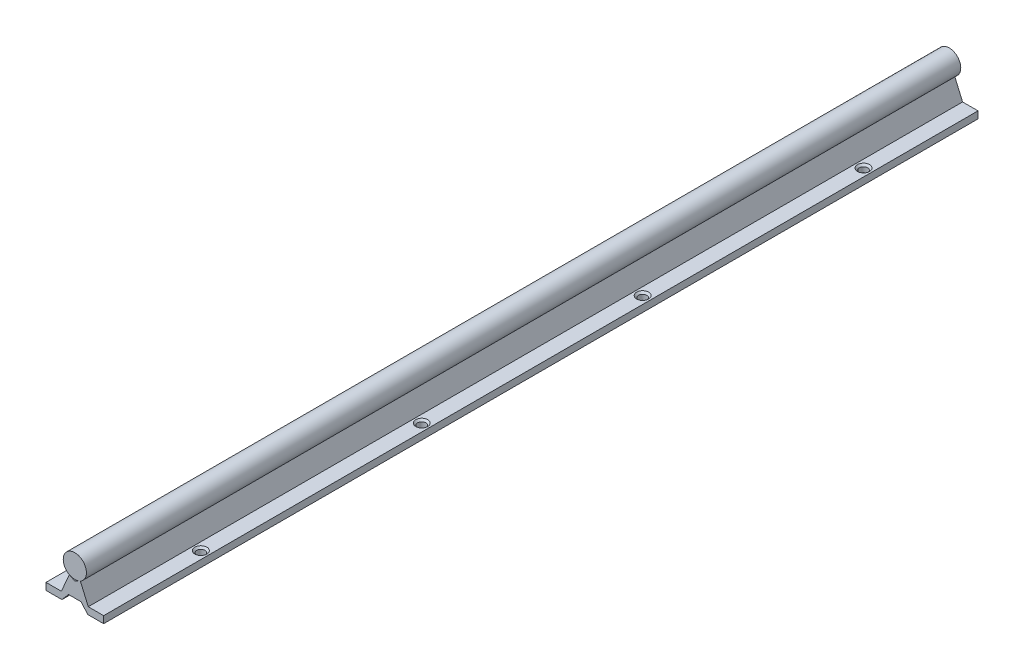
ISO-10303-21;
HEADER;
FILE_DESCRIPTION(('STEP AP214'),'2;1');
FILE_NAME('part.step','',(''),(''),'','','');
FILE_SCHEMA(('AUTOMOTIVE_DESIGN { 1 0 10303 214 1 1 1 1 }'));
ENDSEC;
DATA;
#1=APPLICATION_CONTEXT('core data for automotive mechanical design processes');
#2=APPLICATION_PROTOCOL_DEFINITION('international standard','automotive_design',2000,#1);
#3=PRODUCT_CONTEXT('',#1,'mechanical');
#4=PRODUCT('Part','Part','',(#3));
#5=PRODUCT_RELATED_PRODUCT_CATEGORY('part','',(#4));
#6=PRODUCT_DEFINITION_FORMATION('','',#4);
#7=PRODUCT_DEFINITION_CONTEXT('part definition',#1,'design');
#8=PRODUCT_DEFINITION('design','',#6,#7);
#9=PRODUCT_DEFINITION_SHAPE('','',#8);
#10=(LENGTH_UNIT() NAMED_UNIT(*) SI_UNIT(.MILLI.,.METRE.));
#11=(NAMED_UNIT(*) PLANE_ANGLE_UNIT() SI_UNIT($,.RADIAN.));
#12=(NAMED_UNIT(*) SI_UNIT($,.STERADIAN.) SOLID_ANGLE_UNIT());
#13=UNCERTAINTY_MEASURE_WITH_UNIT(LENGTH_MEASURE(1.E-05),#10,'distance_accuracy_value','');
#14=(GEOMETRIC_REPRESENTATION_CONTEXT(3) GLOBAL_UNCERTAINTY_ASSIGNED_CONTEXT((#13)) GLOBAL_UNIT_ASSIGNED_CONTEXT((#10,
#11,#12)) REPRESENTATION_CONTEXT('',''));
#15=CARTESIAN_POINT('',(0.,0.,0.));
#16=DIRECTION('',(0.,0.,1.));
#17=DIRECTION('',(1.,0.,0.));
#18=AXIS2_PLACEMENT_3D('',#15,#16,#17);
#19=CARTESIAN_POINT('',(0.,9.017,-301.625));
#20=DIRECTION('',(0.,0.,1.));
#21=DIRECTION('',(1.,0.,0.));
#22=AXIS2_PLACEMENT_3D('',#19,#20,#21);
#23=CYLINDRICAL_SURFACE('',#22,8.001);
#24=CARTESIAN_POINT('',(0.,9.017,301.625));
#25=DIRECTION('',(0.,0.,1.));
#26=DIRECTION('',(1.,0.,0.));
#27=AXIS2_PLACEMENT_3D('',#24,#25,#26);
#28=CIRCLE('',#27,8.001);
#29=CARTESIAN_POINT('',(3.81,1.98138339589201,301.625));
#30=VERTEX_POINT('',#29);
#31=CARTESIAN_POINT('',(-3.81,1.98138339589201,301.625));
#32=VERTEX_POINT('',#31);
#33=EDGE_CURVE('E438',#30,#32,#28,.T.);
#34=ORIENTED_EDGE('',*,*,#33,.F.);
#35=DIRECTION('',(0.,0.,1.));
#36=VECTOR('',#35,1.);
#37=CARTESIAN_POINT('',(3.81,1.98138339589201,-301.625));
#38=LINE('',#37,#36);
#39=CARTESIAN_POINT('',(3.81,1.98138339589201,-301.625));
#40=VERTEX_POINT('',#39);
#41=EDGE_CURVE('E473',#40,#30,#38,.T.);
#42=ORIENTED_EDGE('',*,*,#41,.F.);
#43=CARTESIAN_POINT('',(0.,9.017,-301.625));
#44=DIRECTION('',(0.,0.,1.));
#45=DIRECTION('',(1.,0.,0.));
#46=AXIS2_PLACEMENT_3D('',#43,#44,#45);
#47=CIRCLE('',#46,8.001);
#48=CARTESIAN_POINT('',(-3.81,1.98138339589201,-301.625));
#49=VERTEX_POINT('',#48);
#50=EDGE_CURVE('E475',#40,#49,#47,.T.);
#51=ORIENTED_EDGE('',*,*,#50,.T.);
#52=DIRECTION('',(0.,0.,1.));
#53=VECTOR('',#52,1.);
#54=CARTESIAN_POINT('',(-3.81,1.98138339589201,-301.625));
#55=LINE('',#54,#53);
#56=EDGE_CURVE('E113',#49,#32,#55,.T.);
#57=ORIENTED_EDGE('',*,*,#56,.T.);
#58=EDGE_LOOP('',(#34,#42,#51,#57));
#59=FACE_BOUND('',#58,.T.);
#60=ADVANCED_FACE('F95',(#59),#23,.T.);
#61=CARTESIAN_POINT('',(-3.57206746255299,1.85764702344058,301.625));
#62=VERTEX_POINT('',#61);
#63=CARTESIAN_POINT('',(3.57206746255307,1.85764702344062,301.625));
#64=VERTEX_POINT('',#63);
#65=EDGE_CURVE('E209',#62,#64,#28,.T.);
#66=ORIENTED_EDGE('',*,*,#65,.F.);
#67=DIRECTION('',(0.,0.,1.));
#68=VECTOR('',#67,1.);
#69=CARTESIAN_POINT('',(-3.57206746255299,1.85764702344058,-301.625));
#70=LINE('',#69,#68);
#71=CARTESIAN_POINT('',(-3.57206746255299,1.85764702344058,-301.625));
#72=VERTEX_POINT('',#71);
#73=EDGE_CURVE('E227',#72,#62,#70,.T.);
#74=ORIENTED_EDGE('',*,*,#73,.F.);
#75=CARTESIAN_POINT('',(3.57206746255307,1.85764702344062,-301.625));
#76=VERTEX_POINT('',#75);
#77=EDGE_CURVE('E478',#72,#76,#47,.T.);
#78=ORIENTED_EDGE('',*,*,#77,.T.);
#79=DIRECTION('',(0.,0.,1.));
#80=VECTOR('',#79,1.);
#81=CARTESIAN_POINT('',(3.57206746255307,1.85764702344062,-301.625));
#82=LINE('',#81,#80);
#83=EDGE_CURVE('E481',#76,#64,#82,.T.);
#84=ORIENTED_EDGE('',*,*,#83,.T.);
#85=EDGE_LOOP('',(#66,#74,#78,#84));
#86=FACE_BOUND('',#85,.T.);
#87=ADVANCED_FACE('F492',(#86),#23,.T.);
#88=CARTESIAN_POINT('',(0.,0.,301.625));
#89=DIRECTION('',(0.,0.,1.));
#90=DIRECTION('',(1.,0.,0.));
#91=AXIS2_PLACEMENT_3D('',#88,#89,#90);
#92=PLANE('',#91);
#93=ORIENTED_EDGE('',*,*,#33,.T.);
#94=DIRECTION('',(-0.396360542946559,-0.918094940621671,0.));
#95=VECTOR('',#94,1.);
#96=CARTESIAN_POINT('',(-3.81,1.98138339589201,301.625));
#97=LINE('',#96,#95);
#98=CARTESIAN_POINT('',(-9.271,-10.668,301.625));
#99=VERTEX_POINT('',#98);
#100=EDGE_CURVE('E228',#32,#99,#97,.T.);
#101=ORIENTED_EDGE('',*,*,#100,.T.);
#102=DIRECTION('',(-1.,0.,0.));
#103=VECTOR('',#102,1.);
#104=CARTESIAN_POINT('',(-9.271,-10.668,301.625));
#105=LINE('',#104,#103);
#106=CARTESIAN_POINT('',(-19.8882,-10.668,301.625));
#107=VERTEX_POINT('',#106);
#108=EDGE_CURVE('E232',#99,#107,#105,.T.);
#109=ORIENTED_EDGE('',*,*,#108,.T.);
#110=DIRECTION('',(0.,-1.,0.));
#111=VECTOR('',#110,1.);
#112=CARTESIAN_POINT('',(-19.8882,-10.668,301.625));
#113=LINE('',#112,#111);
#114=CARTESIAN_POINT('',(-19.8882,-15.494,301.625));
#115=VERTEX_POINT('',#114);
#116=EDGE_CURVE('E242',#107,#115,#113,.T.);
#117=ORIENTED_EDGE('',*,*,#116,.T.);
#118=DIRECTION('',(1.,0.,0.));
#119=VECTOR('',#118,1.);
#120=CARTESIAN_POINT('',(-19.8882,-15.494,301.625));
#121=LINE('',#120,#119);
#122=CARTESIAN_POINT('',(-8.89,-15.494,301.625));
#123=VERTEX_POINT('',#122);
#124=EDGE_CURVE('E245',#115,#123,#121,.T.);
#125=ORIENTED_EDGE('',*,*,#124,.T.);
#126=DIRECTION('',(0.646593359584783,0.762834862431486,0.));
#127=VECTOR('',#126,1.);
#128=CARTESIAN_POINT('',(-8.89,-15.494,301.625));
#129=LINE('',#128,#127);
#130=CARTESIAN_POINT('',(-4.3688,-10.16,301.625));
#131=VERTEX_POINT('',#130);
#132=EDGE_CURVE('E248',#123,#131,#129,.T.);
#133=ORIENTED_EDGE('',*,*,#132,.T.);
#134=DIRECTION('',(1.,0.,0.));
#135=VECTOR('',#134,1.);
#136=CARTESIAN_POINT('',(-4.3688,-10.16,301.625));
#137=LINE('',#136,#135);
#138=CARTESIAN_POINT('',(4.3688,-10.16,301.625));
#139=VERTEX_POINT('',#138);
#140=EDGE_CURVE('E251',#131,#139,#137,.T.);
#141=ORIENTED_EDGE('',*,*,#140,.T.);
#142=DIRECTION('',(0.646593359584783,-0.762834862431486,0.));
#143=VECTOR('',#142,1.);
#144=CARTESIAN_POINT('',(4.3688,-10.16,301.625));
#145=LINE('',#144,#143);
#146=CARTESIAN_POINT('',(8.89,-15.494,301.625));
#147=VERTEX_POINT('',#146);
#148=EDGE_CURVE('E254',#139,#147,#145,.T.);
#149=ORIENTED_EDGE('',*,*,#148,.T.);
#150=DIRECTION('',(1.,0.,0.));
#151=VECTOR('',#150,1.);
#152=CARTESIAN_POINT('',(8.89,-15.494,301.625));
#153=LINE('',#152,#151);
#154=CARTESIAN_POINT('',(19.8882,-15.494,301.625));
#155=VERTEX_POINT('',#154);
#156=EDGE_CURVE('E257',#147,#155,#153,.T.);
#157=ORIENTED_EDGE('',*,*,#156,.T.);
#158=DIRECTION('',(0.,1.,0.));
#159=VECTOR('',#158,1.);
#160=CARTESIAN_POINT('',(19.8882,-15.494,301.625));
#161=LINE('',#160,#159);
#162=CARTESIAN_POINT('',(19.8882,-10.668,301.625));
#163=VERTEX_POINT('',#162);
#164=EDGE_CURVE('E260',#155,#163,#161,.T.);
#165=ORIENTED_EDGE('',*,*,#164,.T.);
#166=DIRECTION('',(-1.,0.,0.));
#167=VECTOR('',#166,1.);
#168=CARTESIAN_POINT('',(19.8882,-10.668,301.625));
#169=LINE('',#168,#167);
#170=CARTESIAN_POINT('',(9.271,-10.668,301.625));
#171=VERTEX_POINT('',#170);
#172=EDGE_CURVE('E263',#163,#171,#169,.T.);
#173=ORIENTED_EDGE('',*,*,#172,.T.);
#174=DIRECTION('',(-0.396360542946559,0.918094940621671,0.));
#175=VECTOR('',#174,1.);
#176=CARTESIAN_POINT('',(9.271,-10.668,301.625));
#177=LINE('',#176,#175);
#178=EDGE_CURVE('E213',#171,#30,#177,.T.);
#179=ORIENTED_EDGE('',*,*,#178,.T.);
#180=EDGE_LOOP('',(#93,#101,#109,#117,#125,#133,#141,#149,#157,#165,#173,#179));
#181=FACE_BOUND('',#180,.T.);
#182=DIRECTION('',(-0.887199320305606,0.461386352257272,0.));
#183=VECTOR('',#182,1.);
#184=CARTESIAN_POINT('',(0.,0.,301.625));
#185=LINE('',#184,#183);
#186=CARTESIAN_POINT('',(0.,0.,301.625));
#187=VERTEX_POINT('',#186);
#188=EDGE_CURVE('E207',#187,#62,#185,.T.);
#189=ORIENTED_EDGE('',*,*,#188,.T.);
#190=ORIENTED_EDGE('',*,*,#65,.T.);
#191=DIRECTION('',(-0.887199320305605,-0.461386352257272,0.));
#192=VECTOR('',#191,1.);
#193=CARTESIAN_POINT('',(3.81,1.98138339589201,301.625));
#194=LINE('',#193,#192);
#195=EDGE_CURVE('E203',#64,#187,#194,.T.);
#196=ORIENTED_EDGE('',*,*,#195,.T.);
#197=EDGE_LOOP('',(#189,#190,#196));
#198=FACE_BOUND('',#197,.T.);
#199=ADVANCED_FACE('F205',(#181,#198),#92,.T.);
#200=CARTESIAN_POINT('',(0.,0.,-301.625));
#201=DIRECTION('',(0.,0.,1.));
#202=DIRECTION('',(1.,0.,0.));
#203=AXIS2_PLACEMENT_3D('',#200,#201,#202);
#204=PLANE('',#203);
#205=DIRECTION('',(-0.396360542946559,-0.918094940621671,0.));
#206=VECTOR('',#205,1.);
#207=CARTESIAN_POINT('',(-3.81,1.98138339589201,-301.625));
#208=LINE('',#207,#206);
#209=CARTESIAN_POINT('',(-9.271,-10.668,-301.625));
#210=VERTEX_POINT('',#209);
#211=EDGE_CURVE('E439',#49,#210,#208,.T.);
#212=ORIENTED_EDGE('',*,*,#211,.F.);
#213=ORIENTED_EDGE('',*,*,#50,.F.);
#214=DIRECTION('',(-0.396360542946559,0.918094940621671,0.));
#215=VECTOR('',#214,1.);
#216=CARTESIAN_POINT('',(9.271,-10.668,-301.625));
#217=LINE('',#216,#215);
#218=CARTESIAN_POINT('',(9.271,-10.668,-301.625));
#219=VERTEX_POINT('',#218);
#220=EDGE_CURVE('E470',#219,#40,#217,.T.);
#221=ORIENTED_EDGE('',*,*,#220,.F.);
#222=DIRECTION('',(-1.,0.,0.));
#223=VECTOR('',#222,1.);
#224=CARTESIAN_POINT('',(19.8882,-10.668,-301.625));
#225=LINE('',#224,#223);
#226=CARTESIAN_POINT('',(19.8882,-10.668,-301.625));
#227=VERTEX_POINT('',#226);
#228=EDGE_CURVE('E469',#227,#219,#225,.T.);
#229=ORIENTED_EDGE('',*,*,#228,.F.);
#230=DIRECTION('',(0.,1.,0.));
#231=VECTOR('',#230,1.);
#232=CARTESIAN_POINT('',(19.8882,-15.494,-301.625));
#233=LINE('',#232,#231);
#234=CARTESIAN_POINT('',(19.8882,-15.494,-301.625));
#235=VERTEX_POINT('',#234);
#236=EDGE_CURVE('E466',#235,#227,#233,.T.);
#237=ORIENTED_EDGE('',*,*,#236,.F.);
#238=DIRECTION('',(1.,0.,0.));
#239=VECTOR('',#238,1.);
#240=CARTESIAN_POINT('',(8.89,-15.494,-301.625));
#241=LINE('',#240,#239);
#242=CARTESIAN_POINT('',(8.89,-15.494,-301.625));
#243=VERTEX_POINT('',#242);
#244=EDGE_CURVE('E463',#243,#235,#241,.T.);
#245=ORIENTED_EDGE('',*,*,#244,.F.);
#246=DIRECTION('',(0.646593359584783,-0.762834862431486,0.));
#247=VECTOR('',#246,1.);
#248=CARTESIAN_POINT('',(4.3688,-10.16,-301.625));
#249=LINE('',#248,#247);
#250=CARTESIAN_POINT('',(4.3688,-10.16,-301.625));
#251=VERTEX_POINT('',#250);
#252=EDGE_CURVE('E460',#251,#243,#249,.T.);
#253=ORIENTED_EDGE('',*,*,#252,.F.);
#254=DIRECTION('',(1.,0.,0.));
#255=VECTOR('',#254,1.);
#256=CARTESIAN_POINT('',(-4.3688,-10.16,-301.625));
#257=LINE('',#256,#255);
#258=CARTESIAN_POINT('',(-4.3688,-10.16,-301.625));
#259=VERTEX_POINT('',#258);
#260=EDGE_CURVE('E457',#259,#251,#257,.T.);
#261=ORIENTED_EDGE('',*,*,#260,.F.);
#262=DIRECTION('',(0.646593359584783,0.762834862431486,0.));
#263=VECTOR('',#262,1.);
#264=CARTESIAN_POINT('',(-8.89,-15.494,-301.625));
#265=LINE('',#264,#263);
#266=CARTESIAN_POINT('',(-8.89,-15.494,-301.625));
#267=VERTEX_POINT('',#266);
#268=EDGE_CURVE('E454',#267,#259,#265,.T.);
#269=ORIENTED_EDGE('',*,*,#268,.F.);
#270=DIRECTION('',(1.,0.,0.));
#271=VECTOR('',#270,1.);
#272=CARTESIAN_POINT('',(-19.8882,-15.494,-301.625));
#273=LINE('',#272,#271);
#274=CARTESIAN_POINT('',(-19.8882,-15.494,-301.625));
#275=VERTEX_POINT('',#274);
#276=EDGE_CURVE('E451',#275,#267,#273,.T.);
#277=ORIENTED_EDGE('',*,*,#276,.F.);
#278=DIRECTION('',(0.,-1.,0.));
#279=VECTOR('',#278,1.);
#280=CARTESIAN_POINT('',(-19.8882,-10.668,-301.625));
#281=LINE('',#280,#279);
#282=CARTESIAN_POINT('',(-19.8882,-10.668,-301.625));
#283=VERTEX_POINT('',#282);
#284=EDGE_CURVE('E444',#283,#275,#281,.T.);
#285=ORIENTED_EDGE('',*,*,#284,.F.);
#286=DIRECTION('',(-1.,0.,0.));
#287=VECTOR('',#286,1.);
#288=CARTESIAN_POINT('',(-9.271,-10.668,-301.625));
#289=LINE('',#288,#287);
#290=EDGE_CURVE('E442',#210,#283,#289,.T.);
#291=ORIENTED_EDGE('',*,*,#290,.F.);
#292=EDGE_LOOP('',(#212,#213,#221,#229,#237,#245,#253,#261,#269,#277,#285,#291));
#293=FACE_BOUND('',#292,.T.);
#294=ORIENTED_EDGE('',*,*,#77,.F.);
#295=DIRECTION('',(-0.887199320305606,0.461386352257272,0.));
#296=VECTOR('',#295,1.);
#297=CARTESIAN_POINT('',(0.,0.,-301.625));
#298=LINE('',#297,#296);
#299=CARTESIAN_POINT('',(0.,0.,-301.625));
#300=VERTEX_POINT('',#299);
#301=EDGE_CURVE('E212',#300,#72,#298,.T.);
#302=ORIENTED_EDGE('',*,*,#301,.F.);
#303=DIRECTION('',(-0.887199320305605,-0.461386352257272,0.));
#304=VECTOR('',#303,1.);
#305=CARTESIAN_POINT('',(3.81,1.98138339589201,-301.625));
#306=LINE('',#305,#304);
#307=EDGE_CURVE('E219',#76,#300,#306,.T.);
#308=ORIENTED_EDGE('',*,*,#307,.F.);
#309=EDGE_LOOP('',(#294,#302,#308));
#310=FACE_BOUND('',#309,.T.);
#311=ADVANCED_FACE('F369',(#293,#310),#204,.F.);
#312=CARTESIAN_POINT('',(3.81,1.98138339589201,-301.625));
#313=DIRECTION('',(-0.461386352257272,0.887199320305606,0.));
#314=DIRECTION('',(-0.887199320305606,-0.461386352257272,0.));
#315=AXIS2_PLACEMENT_3D('',#312,#313,#314);
#316=PLANE('',#315);
#317=ORIENTED_EDGE('',*,*,#195,.F.);
#318=ORIENTED_EDGE('',*,*,#83,.F.);
#319=ORIENTED_EDGE('',*,*,#307,.T.);
#320=DIRECTION('',(0.,0.,1.));
#321=VECTOR('',#320,1.);
#322=CARTESIAN_POINT('',(0.,0.,-301.625));
#323=LINE('',#322,#321);
#324=EDGE_CURVE('E216',#300,#187,#323,.T.);
#325=ORIENTED_EDGE('',*,*,#324,.T.);
#326=EDGE_LOOP('',(#317,#318,#319,#325));
#327=FACE_BOUND('',#326,.T.);
#328=ADVANCED_FACE('F217',(#327),#316,.T.);
#329=CARTESIAN_POINT('',(9.271,-10.668,-301.625));
#330=DIRECTION('',(0.918094940621671,0.396360542946559,0.));
#331=DIRECTION('',(-0.396360542946559,0.918094940621671,0.));
#332=AXIS2_PLACEMENT_3D('',#329,#330,#331);
#333=PLANE('',#332);
#334=ORIENTED_EDGE('',*,*,#178,.F.);
#335=DIRECTION('',(0.,0.,1.));
#336=VECTOR('',#335,1.);
#337=CARTESIAN_POINT('',(9.271,-10.668,-301.625));
#338=LINE('',#337,#336);
#339=EDGE_CURVE('E196',#219,#171,#338,.T.);
#340=ORIENTED_EDGE('',*,*,#339,.F.);
#341=ORIENTED_EDGE('',*,*,#220,.T.);
#342=ORIENTED_EDGE('',*,*,#41,.T.);
#343=EDGE_LOOP('',(#334,#340,#341,#342));
#344=FACE_BOUND('',#343,.T.);
#345=ADVANCED_FACE('F374',(#344),#333,.T.);
#346=CARTESIAN_POINT('',(19.8882,-10.668,-301.625));
#347=DIRECTION('',(0.,1.,0.));
#348=DIRECTION('',(-1.,0.,0.));
#349=AXIS2_PLACEMENT_3D('',#346,#347,#348);
#350=PLANE('',#349);
#351=CARTESIAN_POINT('',(14.5796,-10.668,-227.965));
#352=DIRECTION('',(0.,1.,0.));
#353=DIRECTION('',(-1.,0.,0.));
#354=AXIS2_PLACEMENT_3D('',#351,#352,#353);
#355=CIRCLE('',#354,4.14020000000005);
#356=CARTESIAN_POINT('',(10.4394,-10.668,-227.965));
#357=VERTEX_POINT('',#356);
#358=EDGE_CURVE('E309',#357,#357,#355,.F.);
#359=ORIENTED_EDGE('',*,*,#358,.T.);
#360=EDGE_LOOP('',(#359));
#361=FACE_BOUND('',#360,.T.);
#362=CARTESIAN_POINT('',(14.5796,-10.668,-75.5650000000001));
#363=DIRECTION('',(0.,1.,0.));
#364=DIRECTION('',(-1.,0.,0.));
#365=AXIS2_PLACEMENT_3D('',#362,#363,#364);
#366=CIRCLE('',#365,4.14020000000005);
#367=CARTESIAN_POINT('',(10.4394,-10.668,-75.5650000000001));
#368=VERTEX_POINT('',#367);
#369=EDGE_CURVE('E306',#368,#368,#366,.F.);
#370=ORIENTED_EDGE('',*,*,#369,.T.);
#371=EDGE_LOOP('',(#370));
#372=FACE_BOUND('',#371,.T.);
#373=CARTESIAN_POINT('',(14.5796,-10.668,76.835));
#374=DIRECTION('',(0.,1.,0.));
#375=DIRECTION('',(-1.,0.,0.));
#376=AXIS2_PLACEMENT_3D('',#373,#374,#375);
#377=CIRCLE('',#376,4.14020000000005);
#378=CARTESIAN_POINT('',(10.4394,-10.668,76.835));
#379=VERTEX_POINT('',#378);
#380=EDGE_CURVE('E303',#379,#379,#377,.F.);
#381=ORIENTED_EDGE('',*,*,#380,.T.);
#382=EDGE_LOOP('',(#381));
#383=FACE_BOUND('',#382,.T.);
#384=CARTESIAN_POINT('',(14.5796,-10.668,229.235));
#385=DIRECTION('',(0.,1.,0.));
#386=DIRECTION('',(-1.,0.,0.));
#387=AXIS2_PLACEMENT_3D('',#384,#385,#386);
#388=CIRCLE('',#387,4.14020000000004);
#389=CARTESIAN_POINT('',(10.4394,-10.668,229.235));
#390=VERTEX_POINT('',#389);
#391=EDGE_CURVE('E300',#390,#390,#388,.F.);
#392=ORIENTED_EDGE('',*,*,#391,.T.);
#393=EDGE_LOOP('',(#392));
#394=FACE_BOUND('',#393,.T.);
#395=ORIENTED_EDGE('',*,*,#172,.F.);
#396=DIRECTION('',(0.,0.,1.));
#397=VECTOR('',#396,1.);
#398=CARTESIAN_POINT('',(19.8882,-10.668,-301.625));
#399=LINE('',#398,#397);
#400=EDGE_CURVE('E270',#227,#163,#399,.T.);
#401=ORIENTED_EDGE('',*,*,#400,.F.);
#402=ORIENTED_EDGE('',*,*,#228,.T.);
#403=ORIENTED_EDGE('',*,*,#339,.T.);
#404=EDGE_LOOP('',(#395,#401,#402,#403));
#405=FACE_BOUND('',#404,.T.);
#406=ADVANCED_FACE('F380',(#361,#372,#383,#394,#405),#350,.T.);
#407=CARTESIAN_POINT('',(19.8882,-15.494,-301.625));
#408=DIRECTION('',(1.,0.,0.));
#409=DIRECTION('',(0.,1.,0.));
#410=AXIS2_PLACEMENT_3D('',#407,#408,#409);
#411=PLANE('',#410);
#412=ORIENTED_EDGE('',*,*,#164,.F.);
#413=DIRECTION('',(0.,0.,1.));
#414=VECTOR('',#413,1.);
#415=CARTESIAN_POINT('',(19.8882,-15.494,-301.625));
#416=LINE('',#415,#414);
#417=EDGE_CURVE('E273',#235,#155,#416,.T.);
#418=ORIENTED_EDGE('',*,*,#417,.F.);
#419=ORIENTED_EDGE('',*,*,#236,.T.);
#420=ORIENTED_EDGE('',*,*,#400,.T.);
#421=EDGE_LOOP('',(#412,#418,#419,#420));
#422=FACE_BOUND('',#421,.T.);
#423=ADVANCED_FACE('F390',(#422),#411,.T.);
#424=CARTESIAN_POINT('',(8.89,-15.494,-301.625));
#425=DIRECTION('',(0.,-1.,0.));
#426=DIRECTION('',(1.,0.,0.));
#427=AXIS2_PLACEMENT_3D('',#424,#425,#426);
#428=PLANE('',#427);
#429=CARTESIAN_POINT('',(14.5796,-15.494,-75.5650000000001));
#430=DIRECTION('',(0.,1.,0.));
#431=DIRECTION('',(-1.,0.,0.));
#432=AXIS2_PLACEMENT_3D('',#429,#430,#431);
#433=CIRCLE('',#432,2.8702);
#434=CARTESIAN_POINT('',(11.7094,-15.494,-75.5650000000001));
#435=VERTEX_POINT('',#434);
#436=EDGE_CURVE('E737',#435,#435,#433,.T.);
#437=ORIENTED_EDGE('',*,*,#436,.T.);
#438=EDGE_LOOP('',(#437));
#439=FACE_BOUND('',#438,.T.);
#440=CARTESIAN_POINT('',(14.5796,-15.494,76.835));
#441=DIRECTION('',(0.,1.,0.));
#442=DIRECTION('',(-1.,0.,0.));
#443=AXIS2_PLACEMENT_3D('',#440,#441,#442);
#444=CIRCLE('',#443,2.8702);
#445=CARTESIAN_POINT('',(11.7094,-15.494,76.835));
#446=VERTEX_POINT('',#445);
#447=EDGE_CURVE('E731',#446,#446,#444,.T.);
#448=ORIENTED_EDGE('',*,*,#447,.T.);
#449=EDGE_LOOP('',(#448));
#450=FACE_BOUND('',#449,.T.);
#451=CARTESIAN_POINT('',(14.5796,-15.494,-227.965));
#452=DIRECTION('',(0.,1.,0.));
#453=DIRECTION('',(-1.,0.,0.));
#454=AXIS2_PLACEMENT_3D('',#451,#452,#453);
#455=CIRCLE('',#454,2.8702);
#456=CARTESIAN_POINT('',(11.7094,-15.494,-227.965));
#457=VERTEX_POINT('',#456);
#458=EDGE_CURVE('E743',#457,#457,#455,.T.);
#459=ORIENTED_EDGE('',*,*,#458,.T.);
#460=EDGE_LOOP('',(#459));
#461=FACE_BOUND('',#460,.T.);
#462=CARTESIAN_POINT('',(14.5796,-15.494,229.235));
#463=DIRECTION('',(0.,1.,0.));
#464=DIRECTION('',(-1.,0.,0.));
#465=AXIS2_PLACEMENT_3D('',#462,#463,#464);
#466=CIRCLE('',#465,2.8702);
#467=CARTESIAN_POINT('',(11.7094,-15.494,229.235));
#468=VERTEX_POINT('',#467);
#469=EDGE_CURVE('E229',#468,#468,#466,.T.);
#470=ORIENTED_EDGE('',*,*,#469,.T.);
#471=EDGE_LOOP('',(#470));
#472=FACE_BOUND('',#471,.T.);
#473=ORIENTED_EDGE('',*,*,#156,.F.);
#474=DIRECTION('',(0.,0.,1.));
#475=VECTOR('',#474,1.);
#476=CARTESIAN_POINT('',(8.89,-15.494,-301.625));
#477=LINE('',#476,#475);
#478=EDGE_CURVE('E276',#243,#147,#477,.T.);
#479=ORIENTED_EDGE('',*,*,#478,.F.);
#480=ORIENTED_EDGE('',*,*,#244,.T.);
#481=ORIENTED_EDGE('',*,*,#417,.T.);
#482=EDGE_LOOP('',(#473,#479,#480,#481));
#483=FACE_BOUND('',#482,.T.);
#484=ADVANCED_FACE('F394',(#439,#450,#461,#472,#483),#428,.T.);
#485=CARTESIAN_POINT('',(4.3688,-10.16,-301.625));
#486=DIRECTION('',(-0.762834862431486,-0.646593359584783,0.));
#487=DIRECTION('',(0.646593359584783,-0.762834862431486,0.));
#488=AXIS2_PLACEMENT_3D('',#485,#486,#487);
#489=PLANE('',#488);
#490=ORIENTED_EDGE('',*,*,#148,.F.);
#491=DIRECTION('',(0.,0.,1.));
#492=VECTOR('',#491,1.);
#493=CARTESIAN_POINT('',(4.3688,-10.16,-301.625));
#494=LINE('',#493,#492);
#495=EDGE_CURVE('E279',#251,#139,#494,.T.);
#496=ORIENTED_EDGE('',*,*,#495,.F.);
#497=ORIENTED_EDGE('',*,*,#252,.T.);
#498=ORIENTED_EDGE('',*,*,#478,.T.);
#499=EDGE_LOOP('',(#490,#496,#497,#498));
#500=FACE_BOUND('',#499,.T.);
#501=ADVANCED_FACE('F398',(#500),#489,.T.);
#502=CARTESIAN_POINT('',(-4.3688,-10.16,-301.625));
#503=DIRECTION('',(0.,-1.,0.));
#504=DIRECTION('',(1.,0.,0.));
#505=AXIS2_PLACEMENT_3D('',#502,#503,#504);
#506=PLANE('',#505);
#507=ORIENTED_EDGE('',*,*,#140,.F.);
#508=DIRECTION('',(0.,0.,1.));
#509=VECTOR('',#508,1.);
#510=CARTESIAN_POINT('',(-4.3688,-10.16,-301.625));
#511=LINE('',#510,#509);
#512=EDGE_CURVE('E282',#259,#131,#511,.T.);
#513=ORIENTED_EDGE('',*,*,#512,.F.);
#514=ORIENTED_EDGE('',*,*,#260,.T.);
#515=ORIENTED_EDGE('',*,*,#495,.T.);
#516=EDGE_LOOP('',(#507,#513,#514,#515));
#517=FACE_BOUND('',#516,.T.);
#518=ADVANCED_FACE('F402',(#517),#506,.T.);
#519=CARTESIAN_POINT('',(-8.89,-15.494,-301.625));
#520=DIRECTION('',(0.762834862431486,-0.646593359584783,0.));
#521=DIRECTION('',(0.646593359584783,0.762834862431486,0.));
#522=AXIS2_PLACEMENT_3D('',#519,#520,#521);
#523=PLANE('',#522);
#524=ORIENTED_EDGE('',*,*,#132,.F.);
#525=DIRECTION('',(0.,0.,1.));
#526=VECTOR('',#525,1.);
#527=CARTESIAN_POINT('',(-8.89,-15.494,-301.625));
#528=LINE('',#527,#526);
#529=EDGE_CURVE('E285',#267,#123,#528,.T.);
#530=ORIENTED_EDGE('',*,*,#529,.F.);
#531=ORIENTED_EDGE('',*,*,#268,.T.);
#532=ORIENTED_EDGE('',*,*,#512,.T.);
#533=EDGE_LOOP('',(#524,#530,#531,#532));
#534=FACE_BOUND('',#533,.T.);
#535=ADVANCED_FACE('F406',(#534),#523,.T.);
#536=CARTESIAN_POINT('',(-19.8882,-15.494,-301.625));
#537=DIRECTION('',(0.,-1.,0.));
#538=DIRECTION('',(0.,0.,-1.));
#539=AXIS2_PLACEMENT_3D('',#536,#537,#538);
#540=PLANE('',#539);
#541=CARTESIAN_POINT('',(-14.5796,-15.494,76.835));
#542=DIRECTION('',(0.,1.,0.));
#543=DIRECTION('',(-1.,0.,0.));
#544=AXIS2_PLACEMENT_3D('',#541,#542,#543);
#545=CIRCLE('',#544,2.8702);
#546=CARTESIAN_POINT('',(-17.4498,-15.494,76.835));
#547=VERTEX_POINT('',#546);
#548=EDGE_CURVE('E733',#547,#547,#545,.T.);
#549=ORIENTED_EDGE('',*,*,#548,.T.);
#550=EDGE_LOOP('',(#549));
#551=FACE_BOUND('',#550,.T.);
#552=CARTESIAN_POINT('',(-14.5796,-15.494,229.235));
#553=DIRECTION('',(0.,1.,0.));
#554=DIRECTION('',(-1.,0.,0.));
#555=AXIS2_PLACEMENT_3D('',#552,#553,#554);
#556=CIRCLE('',#555,2.8702);
#557=CARTESIAN_POINT('',(-17.4498,-15.494,229.235));
#558=VERTEX_POINT('',#557);
#559=EDGE_CURVE('E235',#558,#558,#556,.T.);
#560=ORIENTED_EDGE('',*,*,#559,.T.);
#561=EDGE_LOOP('',(#560));
#562=FACE_BOUND('',#561,.T.);
#563=CARTESIAN_POINT('',(-14.5796,-15.494,-227.965));
#564=DIRECTION('',(0.,1.,0.));
#565=DIRECTION('',(-1.,0.,0.));
#566=AXIS2_PLACEMENT_3D('',#563,#564,#565);
#567=CIRCLE('',#566,2.8702);
#568=CARTESIAN_POINT('',(-17.4498,-15.494,-227.965));
#569=VERTEX_POINT('',#568);
#570=EDGE_CURVE('E746',#569,#569,#567,.T.);
#571=ORIENTED_EDGE('',*,*,#570,.T.);
#572=EDGE_LOOP('',(#571));
#573=FACE_BOUND('',#572,.T.);
#574=CARTESIAN_POINT('',(-14.5796,-15.494,-75.5650000000001));
#575=DIRECTION('',(0.,1.,0.));
#576=DIRECTION('',(-1.,0.,0.));
#577=AXIS2_PLACEMENT_3D('',#574,#575,#576);
#578=CIRCLE('',#577,2.8702);
#579=CARTESIAN_POINT('',(-17.4498,-15.494,-75.5650000000001));
#580=VERTEX_POINT('',#579);
#581=EDGE_CURVE('E741',#580,#580,#578,.T.);
#582=ORIENTED_EDGE('',*,*,#581,.T.);
#583=EDGE_LOOP('',(#582));
#584=FACE_BOUND('',#583,.T.);
#585=ORIENTED_EDGE('',*,*,#124,.F.);
#586=DIRECTION('',(0.,0.,1.));
#587=VECTOR('',#586,1.);
#588=CARTESIAN_POINT('',(-19.8882,-15.494,-301.625));
#589=LINE('',#588,#587);
#590=EDGE_CURVE('E288',#275,#115,#589,.T.);
#591=ORIENTED_EDGE('',*,*,#590,.F.);
#592=ORIENTED_EDGE('',*,*,#276,.T.);
#593=ORIENTED_EDGE('',*,*,#529,.T.);
#594=EDGE_LOOP('',(#585,#591,#592,#593));
#595=FACE_BOUND('',#594,.T.);
#596=ADVANCED_FACE('F410',(#551,#562,#573,#584,#595),#540,.T.);
#597=CARTESIAN_POINT('',(-19.8882,-10.668,-301.625));
#598=DIRECTION('',(-1.,0.,0.));
#599=DIRECTION('',(0.,-1.,0.));
#600=AXIS2_PLACEMENT_3D('',#597,#598,#599);
#601=PLANE('',#600);
#602=ORIENTED_EDGE('',*,*,#116,.F.);
#603=DIRECTION('',(0.,0.,1.));
#604=VECTOR('',#603,1.);
#605=CARTESIAN_POINT('',(-19.8882,-10.668,-301.625));
#606=LINE('',#605,#604);
#607=EDGE_CURVE('E291',#283,#107,#606,.T.);
#608=ORIENTED_EDGE('',*,*,#607,.F.);
#609=ORIENTED_EDGE('',*,*,#284,.T.);
#610=ORIENTED_EDGE('',*,*,#590,.T.);
#611=EDGE_LOOP('',(#602,#608,#609,#610));
#612=FACE_BOUND('',#611,.T.);
#613=ADVANCED_FACE('F414',(#612),#601,.T.);
#614=CARTESIAN_POINT('',(-9.271,-10.668,-301.625));
#615=DIRECTION('',(0.,1.,0.));
#616=DIRECTION('',(0.,0.,1.));
#617=AXIS2_PLACEMENT_3D('',#614,#615,#616);
#618=PLANE('',#617);
#619=CARTESIAN_POINT('',(-14.5796,-10.668,-227.965));
#620=DIRECTION('',(0.,1.,0.));
#621=DIRECTION('',(0.,0.,1.));
#622=AXIS2_PLACEMENT_3D('',#619,#620,#621);
#623=CIRCLE('',#622,4.14019999999987);
#624=CARTESIAN_POINT('',(-14.5796,-10.668,-223.8248));
#625=VERTEX_POINT('',#624);
#626=EDGE_CURVE('E324',#625,#625,#623,.F.);
#627=ORIENTED_EDGE('',*,*,#626,.T.);
#628=EDGE_LOOP('',(#627));
#629=FACE_BOUND('',#628,.T.);
#630=CARTESIAN_POINT('',(-14.5796,-10.668,-75.5650000000001));
#631=DIRECTION('',(0.,1.,0.));
#632=DIRECTION('',(0.,0.,1.));
#633=AXIS2_PLACEMENT_3D('',#630,#631,#632);
#634=CIRCLE('',#633,4.14019999999987);
#635=CARTESIAN_POINT('',(-14.5796,-10.668,-71.4248000000002));
#636=VERTEX_POINT('',#635);
#637=EDGE_CURVE('E321',#636,#636,#634,.F.);
#638=ORIENTED_EDGE('',*,*,#637,.T.);
#639=EDGE_LOOP('',(#638));
#640=FACE_BOUND('',#639,.T.);
#641=CARTESIAN_POINT('',(-14.5796,-10.668,76.835));
#642=DIRECTION('',(0.,1.,0.));
#643=DIRECTION('',(0.,0.,1.));
#644=AXIS2_PLACEMENT_3D('',#641,#642,#643);
#645=CIRCLE('',#644,4.14019999999987);
#646=CARTESIAN_POINT('',(-14.5796,-10.668,80.9751999999998));
#647=VERTEX_POINT('',#646);
#648=EDGE_CURVE('E318',#647,#647,#645,.F.);
#649=ORIENTED_EDGE('',*,*,#648,.T.);
#650=EDGE_LOOP('',(#649));
#651=FACE_BOUND('',#650,.T.);
#652=CARTESIAN_POINT('',(-14.5796,-10.668,229.235));
#653=DIRECTION('',(0.,1.,0.));
#654=DIRECTION('',(0.,0.,1.));
#655=AXIS2_PLACEMENT_3D('',#652,#653,#654);
#656=CIRCLE('',#655,4.14019999999987);
#657=CARTESIAN_POINT('',(-14.5796,-10.668,233.3752));
#658=VERTEX_POINT('',#657);
#659=EDGE_CURVE('E315',#658,#658,#656,.F.);
#660=ORIENTED_EDGE('',*,*,#659,.T.);
#661=EDGE_LOOP('',(#660));
#662=FACE_BOUND('',#661,.T.);
#663=ORIENTED_EDGE('',*,*,#108,.F.);
#664=DIRECTION('',(0.,0.,1.));
#665=VECTOR('',#664,1.);
#666=CARTESIAN_POINT('',(-9.271,-10.668,-301.625));
#667=LINE('',#666,#665);
#668=EDGE_CURVE('E294',#210,#99,#667,.T.);
#669=ORIENTED_EDGE('',*,*,#668,.F.);
#670=ORIENTED_EDGE('',*,*,#290,.T.);
#671=ORIENTED_EDGE('',*,*,#607,.T.);
#672=EDGE_LOOP('',(#663,#669,#670,#671));
#673=FACE_BOUND('',#672,.T.);
#674=ADVANCED_FACE('F370',(#629,#640,#651,#662,#673),#618,.T.);
#675=CARTESIAN_POINT('',(-3.81,1.98138339589201,-301.625));
#676=DIRECTION('',(-0.918094940621671,0.396360542946559,0.));
#677=DIRECTION('',(-0.396360542946559,-0.918094940621671,0.));
#678=AXIS2_PLACEMENT_3D('',#675,#676,#677);
#679=PLANE('',#678);
#680=ORIENTED_EDGE('',*,*,#100,.F.);
#681=ORIENTED_EDGE('',*,*,#56,.F.);
#682=ORIENTED_EDGE('',*,*,#211,.T.);
#683=ORIENTED_EDGE('',*,*,#668,.T.);
#684=EDGE_LOOP('',(#680,#681,#682,#683));
#685=FACE_BOUND('',#684,.T.);
#686=ADVANCED_FACE('F360',(#685),#679,.T.);
#687=CARTESIAN_POINT('',(0.,0.,-301.625));
#688=DIRECTION('',(0.461386352257272,0.887199320305606,0.));
#689=DIRECTION('',(-0.887199320305606,0.461386352257272,0.));
#690=AXIS2_PLACEMENT_3D('',#687,#688,#689);
#691=PLANE('',#690);
#692=ORIENTED_EDGE('',*,*,#301,.T.);
#693=ORIENTED_EDGE('',*,*,#73,.T.);
#694=ORIENTED_EDGE('',*,*,#188,.F.);
#695=ORIENTED_EDGE('',*,*,#324,.F.);
#696=EDGE_LOOP('',(#692,#693,#694,#695));
#697=FACE_BOUND('',#696,.T.);
#698=ADVANCED_FACE('F225',(#697),#691,.T.);
#699=CARTESIAN_POINT('',(-14.5796,-15.494,-75.5650000000001));
#700=DIRECTION('',(0.,1.,0.));
#701=DIRECTION('',(-1.,0.,0.));
#702=AXIS2_PLACEMENT_3D('',#699,#700,#701);
#703=CYLINDRICAL_SURFACE('',#702,2.8702);
#704=CARTESIAN_POINT('',(-14.5796,-11.9379999999999,-75.5650000000001));
#705=DIRECTION('',(0.,1.,0.));
#706=DIRECTION('',(0.,0.,1.));
#707=AXIS2_PLACEMENT_3D('',#704,#705,#706);
#708=CIRCLE('',#707,2.8702);
#709=CARTESIAN_POINT('',(-14.5796,-11.9379999999999,-72.6948));
#710=VERTEX_POINT('',#709);
#711=EDGE_CURVE('E330',#710,#710,#708,.T.);
#712=ORIENTED_EDGE('',*,*,#711,.T.);
#713=EDGE_LOOP('',(#712));
#714=FACE_BOUND('',#713,.T.);
#715=ORIENTED_EDGE('',*,*,#581,.F.);
#716=EDGE_LOOP('',(#715));
#717=FACE_BOUND('',#716,.T.);
#718=ADVANCED_FACE('F359',(#714,#717),#703,.F.);
#719=CARTESIAN_POINT('',(-14.5796,-15.494,-227.965));
#720=DIRECTION('',(0.,1.,0.));
#721=DIRECTION('',(-1.,0.,0.));
#722=AXIS2_PLACEMENT_3D('',#719,#720,#721);
#723=CYLINDRICAL_SURFACE('',#722,2.8702);
#724=CARTESIAN_POINT('',(-14.5796,-11.9379999999999,-227.965));
#725=DIRECTION('',(0.,1.,0.));
#726=DIRECTION('',(0.,0.,1.));
#727=AXIS2_PLACEMENT_3D('',#724,#725,#726);
#728=CIRCLE('',#727,2.8702);
#729=CARTESIAN_POINT('',(-14.5796,-11.9379999999999,-225.0948));
#730=VERTEX_POINT('',#729);
#731=EDGE_CURVE('E312',#730,#730,#728,.T.);
#732=ORIENTED_EDGE('',*,*,#731,.T.);
#733=EDGE_LOOP('',(#732));
#734=FACE_BOUND('',#733,.T.);
#735=ORIENTED_EDGE('',*,*,#570,.F.);
#736=EDGE_LOOP('',(#735));
#737=FACE_BOUND('',#736,.T.);
#738=ADVANCED_FACE('F366',(#734,#737),#723,.F.);
#739=CARTESIAN_POINT('',(-14.5796,-15.494,229.235));
#740=DIRECTION('',(0.,1.,0.));
#741=DIRECTION('',(-1.,0.,0.));
#742=AXIS2_PLACEMENT_3D('',#739,#740,#741);
#743=CYLINDRICAL_SURFACE('',#742,2.8702);
#744=CARTESIAN_POINT('',(-14.5796,-11.9379999999999,229.235));
#745=DIRECTION('',(0.,1.,0.));
#746=DIRECTION('',(0.,0.,1.));
#747=AXIS2_PLACEMENT_3D('',#744,#745,#746);
#748=CIRCLE('',#747,2.8702);
#749=CARTESIAN_POINT('',(-14.5796,-11.9379999999999,232.1052));
#750=VERTEX_POINT('',#749);
#751=EDGE_CURVE('E12',#750,#750,#748,.T.);
#752=ORIENTED_EDGE('',*,*,#751,.T.);
#753=EDGE_LOOP('',(#752));
#754=FACE_BOUND('',#753,.T.);
#755=ORIENTED_EDGE('',*,*,#559,.F.);
#756=EDGE_LOOP('',(#755));
#757=FACE_BOUND('',#756,.T.);
#758=ADVANCED_FACE('F577',(#754,#757),#743,.F.);
#759=CARTESIAN_POINT('',(-14.5796,-15.494,76.835));
#760=DIRECTION('',(0.,1.,0.));
#761=DIRECTION('',(-1.,0.,0.));
#762=AXIS2_PLACEMENT_3D('',#759,#760,#761);
#763=CYLINDRICAL_SURFACE('',#762,2.8702);
#764=CARTESIAN_POINT('',(-14.5796,-11.9379999999999,76.835));
#765=DIRECTION('',(0.,1.,0.));
#766=DIRECTION('',(0.,0.,1.));
#767=AXIS2_PLACEMENT_3D('',#764,#765,#766);
#768=CIRCLE('',#767,2.8702);
#769=CARTESIAN_POINT('',(-14.5796,-11.9379999999999,79.7052));
#770=VERTEX_POINT('',#769);
#771=EDGE_CURVE('E336',#770,#770,#768,.T.);
#772=ORIENTED_EDGE('',*,*,#771,.T.);
#773=EDGE_LOOP('',(#772));
#774=FACE_BOUND('',#773,.T.);
#775=ORIENTED_EDGE('',*,*,#548,.F.);
#776=EDGE_LOOP('',(#775));
#777=FACE_BOUND('',#776,.T.);
#778=ADVANCED_FACE('F586',(#774,#777),#763,.F.);
#779=CARTESIAN_POINT('',(14.5796,-15.494,229.235));
#780=DIRECTION('',(0.,1.,0.));
#781=DIRECTION('',(-1.,0.,0.));
#782=AXIS2_PLACEMENT_3D('',#779,#780,#781);
#783=CYLINDRICAL_SURFACE('',#782,2.8702);
#784=CARTESIAN_POINT('',(14.5796,-11.938,229.235));
#785=DIRECTION('',(0.,1.,0.));
#786=DIRECTION('',(0.,0.,1.));
#787=AXIS2_PLACEMENT_3D('',#784,#785,#786);
#788=CIRCLE('',#787,2.8702);
#789=CARTESIAN_POINT('',(14.5796,-11.938,232.1052));
#790=VERTEX_POINT('',#789);
#791=EDGE_CURVE('E105',#790,#790,#788,.T.);
#792=ORIENTED_EDGE('',*,*,#791,.T.);
#793=EDGE_LOOP('',(#792));
#794=FACE_BOUND('',#793,.T.);
#795=ORIENTED_EDGE('',*,*,#469,.F.);
#796=EDGE_LOOP('',(#795));
#797=FACE_BOUND('',#796,.T.);
#798=ADVANCED_FACE('F341',(#794,#797),#783,.F.);
#799=CARTESIAN_POINT('',(14.5796,-15.494,-227.965));
#800=DIRECTION('',(0.,1.,0.));
#801=DIRECTION('',(-1.,0.,0.));
#802=AXIS2_PLACEMENT_3D('',#799,#800,#801);
#803=CYLINDRICAL_SURFACE('',#802,2.8702);
#804=CARTESIAN_POINT('',(14.5796,-11.938,-227.965));
#805=DIRECTION('',(0.,1.,0.));
#806=DIRECTION('',(0.,0.,1.));
#807=AXIS2_PLACEMENT_3D('',#804,#805,#806);
#808=CIRCLE('',#807,2.8702);
#809=CARTESIAN_POINT('',(14.5796,-11.938,-225.0948));
#810=VERTEX_POINT('',#809);
#811=EDGE_CURVE('E297',#810,#810,#808,.T.);
#812=ORIENTED_EDGE('',*,*,#811,.T.);
#813=EDGE_LOOP('',(#812));
#814=FACE_BOUND('',#813,.T.);
#815=ORIENTED_EDGE('',*,*,#458,.F.);
#816=EDGE_LOOP('',(#815));
#817=FACE_BOUND('',#816,.T.);
#818=ADVANCED_FACE('F603',(#814,#817),#803,.F.);
#819=CARTESIAN_POINT('',(14.5796,-15.494,76.835));
#820=DIRECTION('',(0.,1.,0.));
#821=DIRECTION('',(-1.,0.,0.));
#822=AXIS2_PLACEMENT_3D('',#819,#820,#821);
#823=CYLINDRICAL_SURFACE('',#822,2.8702);
#824=CARTESIAN_POINT('',(14.5796,-11.938,76.835));
#825=DIRECTION('',(0.,1.,0.));
#826=DIRECTION('',(0.,0.,1.));
#827=AXIS2_PLACEMENT_3D('',#824,#825,#826);
#828=CIRCLE('',#827,2.8702);
#829=CARTESIAN_POINT('',(14.5796,-11.938,79.7052));
#830=VERTEX_POINT('',#829);
#831=EDGE_CURVE('E333',#830,#830,#828,.T.);
#832=ORIENTED_EDGE('',*,*,#831,.T.);
#833=EDGE_LOOP('',(#832));
#834=FACE_BOUND('',#833,.T.);
#835=ORIENTED_EDGE('',*,*,#447,.F.);
#836=EDGE_LOOP('',(#835));
#837=FACE_BOUND('',#836,.T.);
#838=ADVANCED_FACE('F611',(#834,#837),#823,.F.);
#839=CARTESIAN_POINT('',(14.5796,-15.494,-75.5650000000001));
#840=DIRECTION('',(0.,1.,0.));
#841=DIRECTION('',(-1.,0.,0.));
#842=AXIS2_PLACEMENT_3D('',#839,#840,#841);
#843=CYLINDRICAL_SURFACE('',#842,2.8702);
#844=CARTESIAN_POINT('',(14.5796,-11.938,-75.5650000000001));
#845=DIRECTION('',(0.,1.,0.));
#846=DIRECTION('',(0.,0.,1.));
#847=AXIS2_PLACEMENT_3D('',#844,#845,#846);
#848=CIRCLE('',#847,2.8702);
#849=CARTESIAN_POINT('',(14.5796,-11.938,-72.6948));
#850=VERTEX_POINT('',#849);
#851=EDGE_CURVE('E327',#850,#850,#848,.T.);
#852=ORIENTED_EDGE('',*,*,#851,.T.);
#853=EDGE_LOOP('',(#852));
#854=FACE_BOUND('',#853,.T.);
#855=ORIENTED_EDGE('',*,*,#436,.F.);
#856=EDGE_LOOP('',(#855));
#857=FACE_BOUND('',#856,.T.);
#858=ADVANCED_FACE('F620',(#854,#857),#843,.F.);
#859=CARTESIAN_POINT('',(14.5796,-11.938,-227.965));
#860=DIRECTION('',(0.,1.,0.));
#861=DIRECTION('',(0.,0.,1.));
#862=AXIS2_PLACEMENT_3D('',#859,#860,#861);
#863=CONICAL_SURFACE('',#862,2.8702,0.785398163397451);
#864=ORIENTED_EDGE('',*,*,#358,.F.);
#865=EDGE_LOOP('',(#864));
#866=FACE_BOUND('',#865,.T.);
#867=ORIENTED_EDGE('',*,*,#811,.F.);
#868=EDGE_LOOP('',(#867));
#869=FACE_BOUND('',#868,.T.);
#870=ADVANCED_FACE('F629',(#866,#869),#863,.F.);
#871=CARTESIAN_POINT('',(-14.5796,-11.9379999999999,-227.965));
#872=DIRECTION('',(0.,1.,0.));
#873=DIRECTION('',(0.,0.,1.));
#874=AXIS2_PLACEMENT_3D('',#871,#872,#873);
#875=CONICAL_SURFACE('',#874,2.8702,0.785398163397443);
#876=ORIENTED_EDGE('',*,*,#626,.F.);
#877=EDGE_LOOP('',(#876));
#878=FACE_BOUND('',#877,.T.);
#879=ORIENTED_EDGE('',*,*,#731,.F.);
#880=EDGE_LOOP('',(#879));
#881=FACE_BOUND('',#880,.T.);
#882=ADVANCED_FACE('F638',(#878,#881),#875,.F.);
#883=CARTESIAN_POINT('',(14.5796,-11.938,-75.5650000000001));
#884=DIRECTION('',(0.,1.,0.));
#885=DIRECTION('',(0.,0.,1.));
#886=AXIS2_PLACEMENT_3D('',#883,#884,#885);
#887=CONICAL_SURFACE('',#886,2.8702,0.785398163397451);
#888=ORIENTED_EDGE('',*,*,#369,.F.);
#889=EDGE_LOOP('',(#888));
#890=FACE_BOUND('',#889,.T.);
#891=ORIENTED_EDGE('',*,*,#851,.F.);
#892=EDGE_LOOP('',(#891));
#893=FACE_BOUND('',#892,.T.);
#894=ADVANCED_FACE('F646',(#890,#893),#887,.F.);
#895=CARTESIAN_POINT('',(-14.5796,-11.9379999999999,-75.5650000000001));
#896=DIRECTION('',(0.,1.,0.));
#897=DIRECTION('',(0.,0.,1.));
#898=AXIS2_PLACEMENT_3D('',#895,#896,#897);
#899=CONICAL_SURFACE('',#898,2.8702,0.785398163397443);
#900=ORIENTED_EDGE('',*,*,#637,.F.);
#901=EDGE_LOOP('',(#900));
#902=FACE_BOUND('',#901,.T.);
#903=ORIENTED_EDGE('',*,*,#711,.F.);
#904=EDGE_LOOP('',(#903));
#905=FACE_BOUND('',#904,.T.);
#906=ADVANCED_FACE('F655',(#902,#905),#899,.F.);
#907=CARTESIAN_POINT('',(14.5796,-11.938,76.835));
#908=DIRECTION('',(0.,1.,0.));
#909=DIRECTION('',(0.,0.,1.));
#910=AXIS2_PLACEMENT_3D('',#907,#908,#909);
#911=CONICAL_SURFACE('',#910,2.8702,0.785398163397451);
#912=ORIENTED_EDGE('',*,*,#380,.F.);
#913=EDGE_LOOP('',(#912));
#914=FACE_BOUND('',#913,.T.);
#915=ORIENTED_EDGE('',*,*,#831,.F.);
#916=EDGE_LOOP('',(#915));
#917=FACE_BOUND('',#916,.T.);
#918=ADVANCED_FACE('F353',(#914,#917),#911,.F.);
#919=CARTESIAN_POINT('',(-14.5796,-11.9379999999999,76.835));
#920=DIRECTION('',(0.,1.,0.));
#921=DIRECTION('',(0.,0.,1.));
#922=AXIS2_PLACEMENT_3D('',#919,#920,#921);
#923=CONICAL_SURFACE('',#922,2.8702,0.785398163397443);
#924=ORIENTED_EDGE('',*,*,#648,.F.);
#925=EDGE_LOOP('',(#924));
#926=FACE_BOUND('',#925,.T.);
#927=ORIENTED_EDGE('',*,*,#771,.F.);
#928=EDGE_LOOP('',(#927));
#929=FACE_BOUND('',#928,.T.);
#930=ADVANCED_FACE('F346',(#926,#929),#923,.F.);
#931=CARTESIAN_POINT('',(14.5796,-11.938,229.235));
#932=DIRECTION('',(0.,1.,0.));
#933=DIRECTION('',(0.,0.,1.));
#934=AXIS2_PLACEMENT_3D('',#931,#932,#933);
#935=CONICAL_SURFACE('',#934,2.8702,0.785398163397449);
#936=ORIENTED_EDGE('',*,*,#391,.F.);
#937=EDGE_LOOP('',(#936));
#938=FACE_BOUND('',#937,.T.);
#939=ORIENTED_EDGE('',*,*,#791,.F.);
#940=EDGE_LOOP('',(#939));
#941=FACE_BOUND('',#940,.T.);
#942=ADVANCED_FACE('F344',(#938,#941),#935,.F.);
#943=CARTESIAN_POINT('',(-14.5796,-11.9379999999999,229.235));
#944=DIRECTION('',(0.,1.,0.));
#945=DIRECTION('',(0.,0.,1.));
#946=AXIS2_PLACEMENT_3D('',#943,#944,#945);
#947=CONICAL_SURFACE('',#946,2.8702,0.785398163397443);
#948=ORIENTED_EDGE('',*,*,#659,.F.);
#949=EDGE_LOOP('',(#948));
#950=FACE_BOUND('',#949,.T.);
#951=ORIENTED_EDGE('',*,*,#751,.F.);
#952=EDGE_LOOP('',(#951));
#953=FACE_BOUND('',#952,.T.);
#954=ADVANCED_FACE('F98',(#950,#953),#947,.F.);
#955=CLOSED_SHELL('',(#60,#87,#199,#311,#328,#345,#406,#423,#484,#501,#518,#535,#596,#613,#674,
#686,#698,#718,#738,#758,#778,#798,#818,#838,#858,#870,#882,#894,#906,#918,#930,#942,#954));
#956=MANIFOLD_SOLID_BREP('B2',#955);
#957=ADVANCED_BREP_SHAPE_REPRESENTATION('',(#18,#956),#14);
#958=SHAPE_DEFINITION_REPRESENTATION(#9,#957);
ENDSEC;
END-ISO-10303-21;
